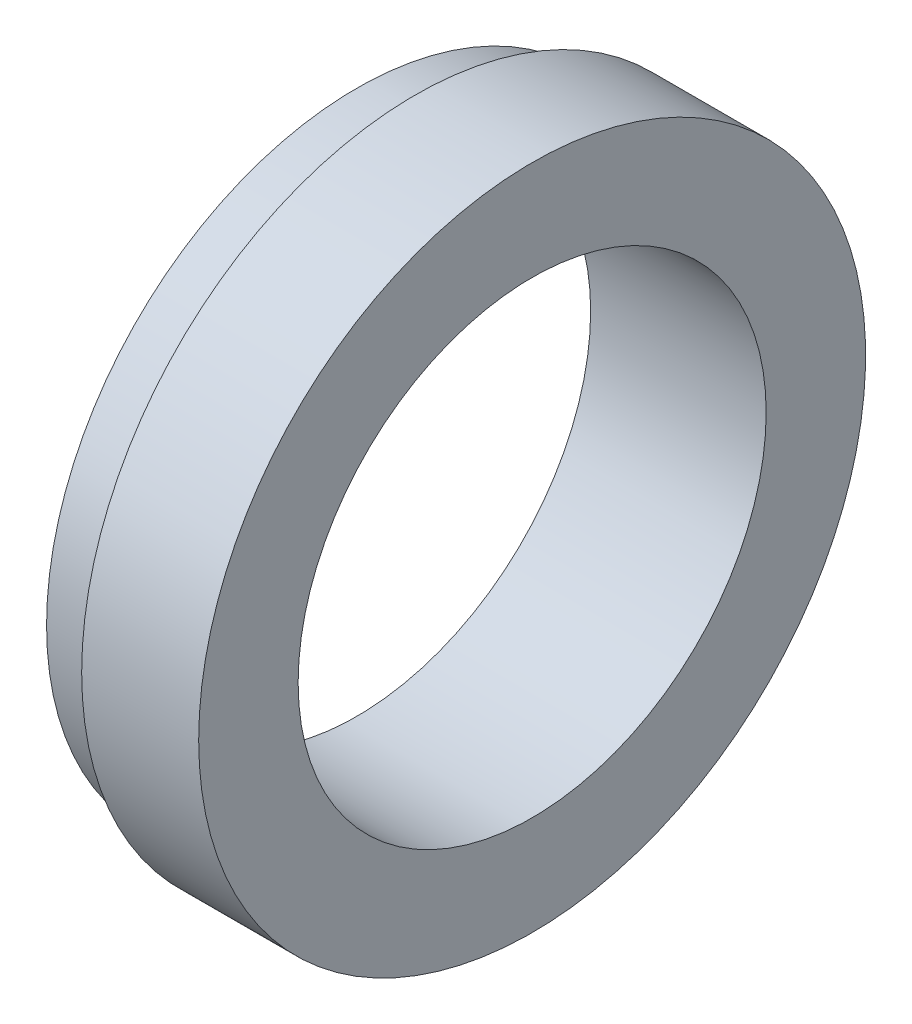
ISO-10303-21;
HEADER;
FILE_DESCRIPTION(('STEP AP214'),'2;1');
FILE_NAME('part.step','',(''),(''),'','','');
FILE_SCHEMA(('AUTOMOTIVE_DESIGN { 1 0 10303 214 1 1 1 1 }'));
ENDSEC;
DATA;
#1=APPLICATION_CONTEXT('core data for automotive mechanical design processes');
#2=APPLICATION_PROTOCOL_DEFINITION('international standard','automotive_design',2000,#1);
#3=PRODUCT_CONTEXT('',#1,'mechanical');
#4=PRODUCT('Part','Part','',(#3));
#5=PRODUCT_RELATED_PRODUCT_CATEGORY('part','',(#4));
#6=PRODUCT_DEFINITION_FORMATION('','',#4);
#7=PRODUCT_DEFINITION_CONTEXT('part definition',#1,'design');
#8=PRODUCT_DEFINITION('design','',#6,#7);
#9=PRODUCT_DEFINITION_SHAPE('','',#8);
#10=(LENGTH_UNIT() NAMED_UNIT(*) SI_UNIT(.MILLI.,.METRE.));
#11=(NAMED_UNIT(*) PLANE_ANGLE_UNIT() SI_UNIT($,.RADIAN.));
#12=(NAMED_UNIT(*) SI_UNIT($,.STERADIAN.) SOLID_ANGLE_UNIT());
#13=UNCERTAINTY_MEASURE_WITH_UNIT(LENGTH_MEASURE(1.E-05),#10,'distance_accuracy_value','');
#14=(GEOMETRIC_REPRESENTATION_CONTEXT(3) GLOBAL_UNCERTAINTY_ASSIGNED_CONTEXT((#13)) GLOBAL_UNIT_ASSIGNED_CONTEXT((#10,
#11,#12)) REPRESENTATION_CONTEXT('',''));
#15=CARTESIAN_POINT('',(0.,0.,0.));
#16=DIRECTION('',(0.,0.,1.));
#17=DIRECTION('',(1.,0.,0.));
#18=AXIS2_PLACEMENT_3D('',#15,#16,#17);
#19=CARTESIAN_POINT('',(0.,0.,0.));
#20=DIRECTION('',(-1.,0.,0.));
#21=DIRECTION('',(0.,0.,1.));
#22=AXIS2_PLACEMENT_3D('',#19,#20,#21);
#23=CYLINDRICAL_SURFACE('',#22,20.);
#24=CARTESIAN_POINT('',(-5.,0.,0.));
#25=DIRECTION('',(-1.,0.,0.));
#26=DIRECTION('',(0.,0.,1.));
#27=AXIS2_PLACEMENT_3D('',#24,#25,#26);
#28=CIRCLE('',#27,20.);
#29=CARTESIAN_POINT('',(-5.,0.,20.));
#30=VERTEX_POINT('',#29);
#31=EDGE_CURVE('E69',#30,#30,#28,.T.);
#32=ORIENTED_EDGE('',*,*,#31,.T.);
#33=EDGE_LOOP('',(#32));
#34=FACE_BOUND('',#33,.T.);
#35=CARTESIAN_POINT('',(10.,0.,0.));
#36=DIRECTION('',(-1.,0.,0.));
#37=DIRECTION('',(0.,0.,1.));
#38=AXIS2_PLACEMENT_3D('',#35,#36,#37);
#39=CIRCLE('',#38,20.);
#40=CARTESIAN_POINT('',(10.,0.,20.));
#41=VERTEX_POINT('',#40);
#42=EDGE_CURVE('E12',#41,#41,#39,.T.);
#43=ORIENTED_EDGE('',*,*,#42,.F.);
#44=EDGE_LOOP('',(#43));
#45=FACE_BOUND('',#44,.T.);
#46=ADVANCED_FACE('F47',(#34,#45),#23,.F.);
#47=CARTESIAN_POINT('',(10.,-20.,0.));
#48=DIRECTION('',(1.,0.,0.));
#49=DIRECTION('',(0.,0.,-1.));
#50=AXIS2_PLACEMENT_3D('',#47,#48,#49);
#51=PLANE('',#50);
#52=ORIENTED_EDGE('',*,*,#42,.T.);
#53=EDGE_LOOP('',(#52));
#54=FACE_BOUND('',#53,.T.);
#55=CARTESIAN_POINT('',(10.,0.,0.));
#56=DIRECTION('',(-1.,0.,0.));
#57=DIRECTION('',(0.,0.,1.));
#58=AXIS2_PLACEMENT_3D('',#55,#56,#57);
#59=CIRCLE('',#58,28.5);
#60=CARTESIAN_POINT('',(10.,0.,28.5));
#61=VERTEX_POINT('',#60);
#62=EDGE_CURVE('E53',#61,#61,#59,.T.);
#63=ORIENTED_EDGE('',*,*,#62,.F.);
#64=EDGE_LOOP('',(#63));
#65=FACE_BOUND('',#64,.T.);
#66=ADVANCED_FACE('F87',(#54,#65),#51,.T.);
#67=CARTESIAN_POINT('',(0.,0.,0.));
#68=DIRECTION('',(-1.,0.,0.));
#69=DIRECTION('',(0.,0.,1.));
#70=AXIS2_PLACEMENT_3D('',#67,#68,#69);
#71=CYLINDRICAL_SURFACE('',#70,28.5);
#72=ORIENTED_EDGE('',*,*,#62,.T.);
#73=EDGE_LOOP('',(#72));
#74=FACE_BOUND('',#73,.T.);
#75=CARTESIAN_POINT('',(0.,0.,0.));
#76=DIRECTION('',(-1.,0.,0.));
#77=DIRECTION('',(0.,0.,1.));
#78=AXIS2_PLACEMENT_3D('',#75,#76,#77);
#79=CIRCLE('',#78,28.5);
#80=CARTESIAN_POINT('',(0.,0.,28.5));
#81=VERTEX_POINT('',#80);
#82=EDGE_CURVE('E57',#81,#81,#79,.T.);
#83=ORIENTED_EDGE('',*,*,#82,.F.);
#84=EDGE_LOOP('',(#83));
#85=FACE_BOUND('',#84,.T.);
#86=ADVANCED_FACE('F91',(#74,#85),#71,.T.);
#87=CARTESIAN_POINT('',(0.,-28.5,0.));
#88=DIRECTION('',(-1.,0.,0.));
#89=DIRECTION('',(0.,0.,1.));
#90=AXIS2_PLACEMENT_3D('',#87,#88,#89);
#91=PLANE('',#90);
#92=ORIENTED_EDGE('',*,*,#82,.T.);
#93=EDGE_LOOP('',(#92));
#94=FACE_BOUND('',#93,.T.);
#95=CARTESIAN_POINT('',(0.,0.,0.));
#96=DIRECTION('',(-1.,0.,0.));
#97=DIRECTION('',(0.,0.,1.));
#98=AXIS2_PLACEMENT_3D('',#95,#96,#97);
#99=CIRCLE('',#98,26.5);
#100=CARTESIAN_POINT('',(0.,0.,26.5));
#101=VERTEX_POINT('',#100);
#102=EDGE_CURVE('E61',#101,#101,#99,.T.);
#103=ORIENTED_EDGE('',*,*,#102,.F.);
#104=EDGE_LOOP('',(#103));
#105=FACE_BOUND('',#104,.T.);
#106=ADVANCED_FACE('F83',(#94,#105),#91,.T.);
#107=CARTESIAN_POINT('',(0.,0.,0.));
#108=DIRECTION('',(-1.,0.,0.));
#109=DIRECTION('',(0.,0.,1.));
#110=AXIS2_PLACEMENT_3D('',#107,#108,#109);
#111=CYLINDRICAL_SURFACE('',#110,26.5);
#112=ORIENTED_EDGE('',*,*,#102,.T.);
#113=EDGE_LOOP('',(#112));
#114=FACE_BOUND('',#113,.T.);
#115=CARTESIAN_POINT('',(-5.,0.,0.));
#116=DIRECTION('',(-1.,0.,0.));
#117=DIRECTION('',(0.,0.,1.));
#118=AXIS2_PLACEMENT_3D('',#115,#116,#117);
#119=CIRCLE('',#118,26.5);
#120=CARTESIAN_POINT('',(-5.,0.,26.5));
#121=VERTEX_POINT('',#120);
#122=EDGE_CURVE('E66',#121,#121,#119,.T.);
#123=ORIENTED_EDGE('',*,*,#122,.F.);
#124=EDGE_LOOP('',(#123));
#125=FACE_BOUND('',#124,.T.);
#126=ADVANCED_FACE('F77',(#114,#125),#111,.T.);
#127=CARTESIAN_POINT('',(-5.,-26.5,0.));
#128=DIRECTION('',(-1.,0.,0.));
#129=DIRECTION('',(0.,0.,1.));
#130=AXIS2_PLACEMENT_3D('',#127,#128,#129);
#131=PLANE('',#130);
#132=ORIENTED_EDGE('',*,*,#122,.T.);
#133=EDGE_LOOP('',(#132));
#134=FACE_BOUND('',#133,.T.);
#135=ORIENTED_EDGE('',*,*,#31,.F.);
#136=EDGE_LOOP('',(#135));
#137=FACE_BOUND('',#136,.T.);
#138=ADVANCED_FACE('F75',(#134,#137),#131,.T.);
#139=CLOSED_SHELL('',(#46,#66,#86,#106,#126,#138));
#140=MANIFOLD_SOLID_BREP('B2',#139);
#141=ADVANCED_BREP_SHAPE_REPRESENTATION('',(#18,#140),#14);
#142=SHAPE_DEFINITION_REPRESENTATION(#9,#141);
ENDSEC;
END-ISO-10303-21;
